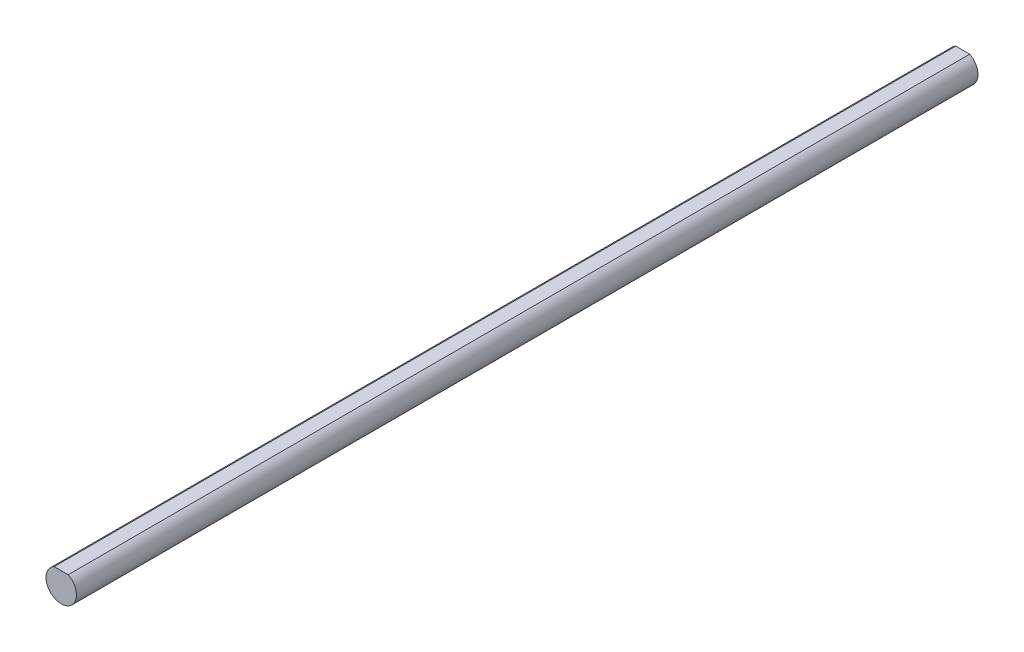
ISO-10303-21;
HEADER;
FILE_DESCRIPTION(('STEP AP214'),'2;1');
FILE_NAME('part.step','',(''),(''),'','','');
FILE_SCHEMA(('AUTOMOTIVE_DESIGN { 1 0 10303 214 1 1 1 1 }'));
ENDSEC;
DATA;
#1=APPLICATION_CONTEXT('core data for automotive mechanical design processes');
#2=APPLICATION_PROTOCOL_DEFINITION('international standard','automotive_design',2000,#1);
#3=PRODUCT_CONTEXT('',#1,'mechanical');
#4=PRODUCT('Part','Part','',(#3));
#5=PRODUCT_RELATED_PRODUCT_CATEGORY('part','',(#4));
#6=PRODUCT_DEFINITION_FORMATION('','',#4);
#7=PRODUCT_DEFINITION_CONTEXT('part definition',#1,'design');
#8=PRODUCT_DEFINITION('design','',#6,#7);
#9=PRODUCT_DEFINITION_SHAPE('','',#8);
#10=(LENGTH_UNIT() NAMED_UNIT(*) SI_UNIT(.MILLI.,.METRE.));
#11=(NAMED_UNIT(*) PLANE_ANGLE_UNIT() SI_UNIT($,.RADIAN.));
#12=(NAMED_UNIT(*) SI_UNIT($,.STERADIAN.) SOLID_ANGLE_UNIT());
#13=UNCERTAINTY_MEASURE_WITH_UNIT(LENGTH_MEASURE(1.E-05),#10,'distance_accuracy_value','');
#14=(GEOMETRIC_REPRESENTATION_CONTEXT(3) GLOBAL_UNCERTAINTY_ASSIGNED_CONTEXT((#13)) GLOBAL_UNIT_ASSIGNED_CONTEXT((#10,
#11,#12)) REPRESENTATION_CONTEXT('',''));
#15=CARTESIAN_POINT('',(0.,0.,0.));
#16=DIRECTION('',(0.,0.,1.));
#17=DIRECTION('',(1.,0.,0.));
#18=AXIS2_PLACEMENT_3D('',#15,#16,#17);
#19=CARTESIAN_POINT('',(0.,0.,-70.));
#20=DIRECTION('',(0.,0.,1.));
#21=DIRECTION('',(1.,0.,0.));
#22=AXIS2_PLACEMENT_3D('',#19,#20,#21);
#23=CYLINDRICAL_SURFACE('',#22,2.365);
#24=CARTESIAN_POINT('',(0.,0.,70.));
#25=DIRECTION('',(0.,0.,1.));
#26=DIRECTION('',(1.,0.,0.));
#27=AXIS2_PLACEMENT_3D('',#24,#25,#26);
#28=CIRCLE('',#27,2.365);
#29=CARTESIAN_POINT('',(-1.0877614628217,2.1,70.));
#30=VERTEX_POINT('',#29);
#31=CARTESIAN_POINT('',(1.0877614628217,2.1,70.));
#32=VERTEX_POINT('',#31);
#33=EDGE_CURVE('E62',#30,#32,#28,.T.);
#34=ORIENTED_EDGE('',*,*,#33,.F.);
#35=DIRECTION('',(0.,0.,1.));
#36=VECTOR('',#35,1.);
#37=CARTESIAN_POINT('',(-1.0877614628217,2.1,-70.));
#38=LINE('',#37,#36);
#39=CARTESIAN_POINT('',(-1.0877614628217,2.1,-70.));
#40=VERTEX_POINT('',#39);
#41=EDGE_CURVE('E11',#40,#30,#38,.T.);
#42=ORIENTED_EDGE('',*,*,#41,.F.);
#43=CARTESIAN_POINT('',(0.,0.,-70.));
#44=DIRECTION('',(0.,0.,1.));
#45=DIRECTION('',(1.,0.,0.));
#46=AXIS2_PLACEMENT_3D('',#43,#44,#45);
#47=CIRCLE('',#46,2.365);
#48=CARTESIAN_POINT('',(1.0877614628217,2.1,-70.));
#49=VERTEX_POINT('',#48);
#50=EDGE_CURVE('E66',#40,#49,#47,.T.);
#51=ORIENTED_EDGE('',*,*,#50,.T.);
#52=DIRECTION('',(0.,0.,1.));
#53=VECTOR('',#52,1.);
#54=CARTESIAN_POINT('',(1.0877614628217,2.1,-70.));
#55=LINE('',#54,#53);
#56=EDGE_CURVE('E36',#49,#32,#55,.T.);
#57=ORIENTED_EDGE('',*,*,#56,.T.);
#58=EDGE_LOOP('',(#34,#42,#51,#57));
#59=FACE_BOUND('',#58,.T.);
#60=ADVANCED_FACE('F33',(#59),#23,.T.);
#61=CARTESIAN_POINT('',(-1.0877614628217,2.1,-70.));
#62=DIRECTION('',(0.,1.,0.));
#63=DIRECTION('',(0.,0.,1.));
#64=AXIS2_PLACEMENT_3D('',#61,#62,#63);
#65=PLANE('',#64);
#66=DIRECTION('',(-1.,0.,0.));
#67=VECTOR('',#66,1.);
#68=CARTESIAN_POINT('',(-1.0877614628217,2.1,70.));
#69=LINE('',#68,#67);
#70=EDGE_CURVE('E59',#32,#30,#69,.T.);
#71=ORIENTED_EDGE('',*,*,#70,.F.);
#72=ORIENTED_EDGE('',*,*,#56,.F.);
#73=DIRECTION('',(-1.,0.,0.));
#74=VECTOR('',#73,1.);
#75=CARTESIAN_POINT('',(-1.0877614628217,2.1,-70.));
#76=LINE('',#75,#74);
#77=EDGE_CURVE('E61',#49,#40,#76,.T.);
#78=ORIENTED_EDGE('',*,*,#77,.T.);
#79=ORIENTED_EDGE('',*,*,#41,.T.);
#80=EDGE_LOOP('',(#71,#72,#78,#79));
#81=FACE_BOUND('',#80,.T.);
#82=ADVANCED_FACE('F57',(#81),#65,.T.);
#83=CARTESIAN_POINT('',(0.,0.,-70.));
#84=DIRECTION('',(0.,0.,1.));
#85=DIRECTION('',(1.,0.,0.));
#86=AXIS2_PLACEMENT_3D('',#83,#84,#85);
#87=PLANE('',#86);
#88=ORIENTED_EDGE('',*,*,#50,.F.);
#89=ORIENTED_EDGE('',*,*,#77,.F.);
#90=EDGE_LOOP('',(#88,#89));
#91=FACE_BOUND('',#90,.T.);
#92=ADVANCED_FACE('F71',(#91),#87,.F.);
#93=CARTESIAN_POINT('',(0.,0.,70.));
#94=DIRECTION('',(0.,0.,1.));
#95=DIRECTION('',(1.,0.,0.));
#96=AXIS2_PLACEMENT_3D('',#93,#94,#95);
#97=PLANE('',#96);
#98=ORIENTED_EDGE('',*,*,#33,.T.);
#99=ORIENTED_EDGE('',*,*,#70,.T.);
#100=EDGE_LOOP('',(#98,#99));
#101=FACE_BOUND('',#100,.T.);
#102=ADVANCED_FACE('F65',(#101),#97,.T.);
#103=CLOSED_SHELL('',(#60,#82,#92,#102));
#104=MANIFOLD_SOLID_BREP('B2',#103);
#105=ADVANCED_BREP_SHAPE_REPRESENTATION('',(#18,#104),#14);
#106=SHAPE_DEFINITION_REPRESENTATION(#9,#105);
ENDSEC;
END-ISO-10303-21;
